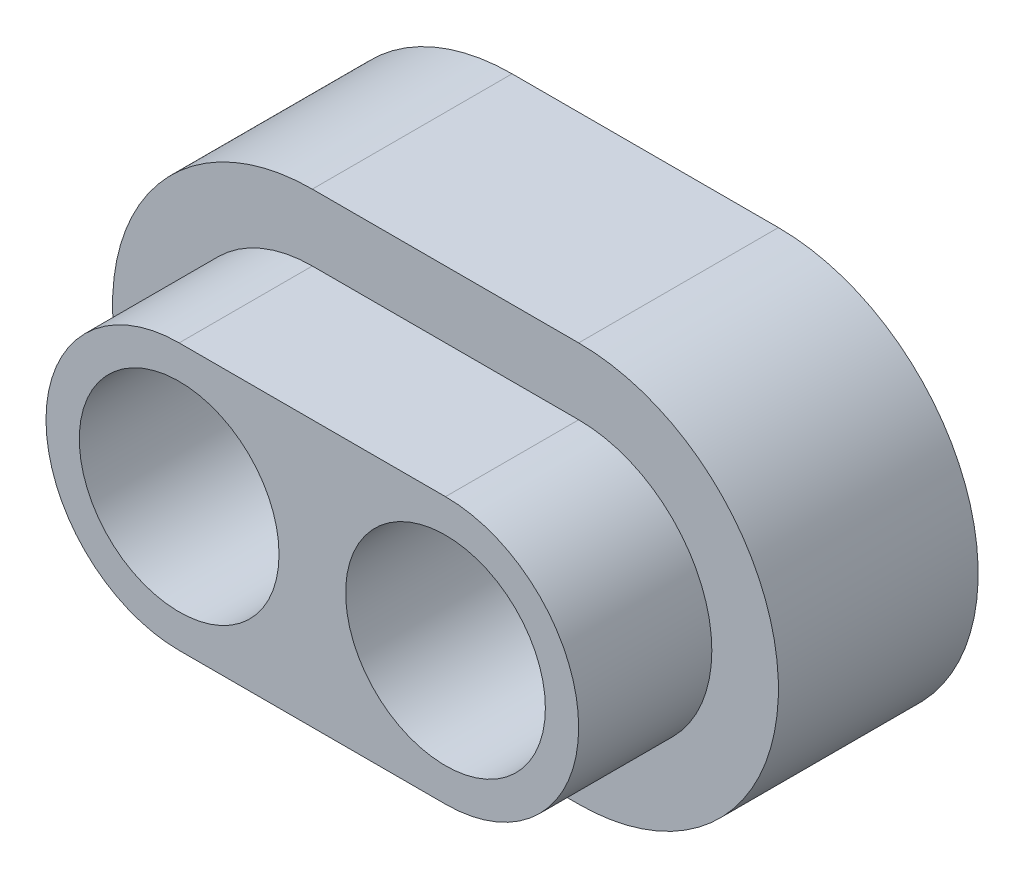
ISO-10303-21;
HEADER;
FILE_DESCRIPTION(('STEP AP214'),'2;1');
FILE_NAME('part.step','',(''),(''),'','','');
FILE_SCHEMA(('AUTOMOTIVE_DESIGN { 1 0 10303 214 1 1 1 1 }'));
ENDSEC;
DATA;
#1=APPLICATION_CONTEXT('core data for automotive mechanical design processes');
#2=APPLICATION_PROTOCOL_DEFINITION('international standard','automotive_design',2000,#1);
#3=PRODUCT_CONTEXT('',#1,'mechanical');
#4=PRODUCT('Part','Part','',(#3));
#5=PRODUCT_RELATED_PRODUCT_CATEGORY('part','',(#4));
#6=PRODUCT_DEFINITION_FORMATION('','',#4);
#7=PRODUCT_DEFINITION_CONTEXT('part definition',#1,'design');
#8=PRODUCT_DEFINITION('design','',#6,#7);
#9=PRODUCT_DEFINITION_SHAPE('','',#8);
#10=(LENGTH_UNIT() NAMED_UNIT(*) SI_UNIT(.MILLI.,.METRE.));
#11=(NAMED_UNIT(*) PLANE_ANGLE_UNIT() SI_UNIT($,.RADIAN.));
#12=(NAMED_UNIT(*) SI_UNIT($,.STERADIAN.) SOLID_ANGLE_UNIT());
#13=UNCERTAINTY_MEASURE_WITH_UNIT(LENGTH_MEASURE(1.E-05),#10,'distance_accuracy_value','');
#14=(GEOMETRIC_REPRESENTATION_CONTEXT(3) GLOBAL_UNCERTAINTY_ASSIGNED_CONTEXT((#13)) GLOBAL_UNIT_ASSIGNED_CONTEXT((#10,
#11,#12)) REPRESENTATION_CONTEXT('',''));
#15=CARTESIAN_POINT('',(0.,0.,0.));
#16=DIRECTION('',(0.,0.,1.));
#17=DIRECTION('',(1.,0.,0.));
#18=AXIS2_PLACEMENT_3D('',#15,#16,#17);
#19=CARTESIAN_POINT('',(-2.,0.,3.));
#20=DIRECTION('',(0.,0.,-1.));
#21=DIRECTION('',(-1.,0.,0.));
#22=AXIS2_PLACEMENT_3D('',#19,#20,#21);
#23=CYLINDRICAL_SURFACE('',#22,3.);
#24=DIRECTION('',(0.,0.,-1.));
#25=VECTOR('',#24,1.);
#26=CARTESIAN_POINT('',(-2.,3.,3.));
#27=LINE('',#26,#25);
#28=CARTESIAN_POINT('',(-2.,3.,0.));
#29=VERTEX_POINT('',#28);
#30=CARTESIAN_POINT('',(-2.,3.,3.));
#31=VERTEX_POINT('',#30);
#32=EDGE_CURVE('E188',#29,#31,#27,.F.);
#33=ORIENTED_EDGE('',*,*,#32,.F.);
#34=CARTESIAN_POINT('',(-2.,0.,0.));
#35=DIRECTION('',(0.,0.,1.));
#36=DIRECTION('',(1.,0.,0.));
#37=AXIS2_PLACEMENT_3D('',#34,#35,#36);
#38=CIRCLE('',#37,3.);
#39=CARTESIAN_POINT('',(-2.,-3.,0.));
#40=VERTEX_POINT('',#39);
#41=EDGE_CURVE('E173',#29,#40,#38,.T.);
#42=ORIENTED_EDGE('',*,*,#41,.T.);
#43=DIRECTION('',(0.,0.,-1.));
#44=VECTOR('',#43,1.);
#45=CARTESIAN_POINT('',(-2.,-3.,3.));
#46=LINE('',#45,#44);
#47=CARTESIAN_POINT('',(-2.,-3.,3.));
#48=VERTEX_POINT('',#47);
#49=EDGE_CURVE('E129',#48,#40,#46,.T.);
#50=ORIENTED_EDGE('',*,*,#49,.F.);
#51=CARTESIAN_POINT('',(-2.,0.,3.));
#52=DIRECTION('',(0.,0.,1.));
#53=DIRECTION('',(1.,0.,0.));
#54=AXIS2_PLACEMENT_3D('',#51,#52,#53);
#55=CIRCLE('',#54,3.);
#56=EDGE_CURVE('E229',#31,#48,#55,.T.);
#57=ORIENTED_EDGE('',*,*,#56,.F.);
#58=EDGE_LOOP('',(#33,#42,#50,#57));
#59=FACE_BOUND('',#58,.T.);
#60=ADVANCED_FACE('F105',(#59),#23,.T.);
#61=CARTESIAN_POINT('',(-2.,0.,0.));
#62=DIRECTION('',(0.,0.,1.));
#63=DIRECTION('',(1.,0.,0.));
#64=AXIS2_PLACEMENT_3D('',#61,#62,#63);
#65=PLANE('',#64);
#66=CARTESIAN_POINT('',(2.,0.,0.));
#67=DIRECTION('',(0.,0.,1.));
#68=DIRECTION('',(1.,0.,0.));
#69=AXIS2_PLACEMENT_3D('',#66,#67,#68);
#70=CIRCLE('',#69,1.5);
#71=CARTESIAN_POINT('',(3.5,0.,0.));
#72=VERTEX_POINT('',#71);
#73=EDGE_CURVE('E274',#72,#72,#70,.T.);
#74=ORIENTED_EDGE('',*,*,#73,.T.);
#75=EDGE_LOOP('',(#74));
#76=FACE_BOUND('',#75,.T.);
#77=CARTESIAN_POINT('',(-2.,0.,0.));
#78=DIRECTION('',(0.,0.,1.));
#79=DIRECTION('',(1.,0.,0.));
#80=AXIS2_PLACEMENT_3D('',#77,#78,#79);
#81=CIRCLE('',#80,1.5);
#82=CARTESIAN_POINT('',(-0.5,0.,0.));
#83=VERTEX_POINT('',#82);
#84=EDGE_CURVE('E271',#83,#83,#81,.T.);
#85=ORIENTED_EDGE('',*,*,#84,.T.);
#86=EDGE_LOOP('',(#85));
#87=FACE_BOUND('',#86,.T.);
#88=DIRECTION('',(1.,0.,0.));
#89=VECTOR('',#88,1.);
#90=CARTESIAN_POINT('',(-2.,3.,0.));
#91=LINE('',#90,#89);
#92=CARTESIAN_POINT('',(2.,3.,0.));
#93=VERTEX_POINT('',#92);
#94=EDGE_CURVE('E155',#29,#93,#91,.T.);
#95=ORIENTED_EDGE('',*,*,#94,.T.);
#96=CARTESIAN_POINT('',(2.,0.,0.));
#97=DIRECTION('',(0.,0.,1.));
#98=DIRECTION('',(1.,0.,0.));
#99=AXIS2_PLACEMENT_3D('',#96,#97,#98);
#100=CIRCLE('',#99,3.);
#101=CARTESIAN_POINT('',(2.,-3.,0.));
#102=VERTEX_POINT('',#101);
#103=EDGE_CURVE('E165',#102,#93,#100,.T.);
#104=ORIENTED_EDGE('',*,*,#103,.F.);
#105=DIRECTION('',(1.,0.,0.));
#106=VECTOR('',#105,1.);
#107=CARTESIAN_POINT('',(-2.,-3.,0.));
#108=LINE('',#107,#106);
#109=EDGE_CURVE('E175',#40,#102,#108,.T.);
#110=ORIENTED_EDGE('',*,*,#109,.F.);
#111=ORIENTED_EDGE('',*,*,#41,.F.);
#112=EDGE_LOOP('',(#95,#104,#110,#111));
#113=FACE_BOUND('',#112,.T.);
#114=ADVANCED_FACE('F172',(#76,#87,#113),#65,.F.);
#115=CARTESIAN_POINT('',(-2.,0.,3.));
#116=DIRECTION('',(0.,0.,1.));
#117=DIRECTION('',(1.,0.,0.));
#118=AXIS2_PLACEMENT_3D('',#115,#116,#117);
#119=PLANE('',#118);
#120=DIRECTION('',(-1.,0.,0.));
#121=VECTOR('',#120,1.);
#122=CARTESIAN_POINT('',(-2.,2.,3.));
#123=LINE('',#122,#121);
#124=CARTESIAN_POINT('',(2.,2.,3.));
#125=VERTEX_POINT('',#124);
#126=CARTESIAN_POINT('',(-2.,2.,3.));
#127=VERTEX_POINT('',#126);
#128=EDGE_CURVE('E12',#125,#127,#123,.T.);
#129=ORIENTED_EDGE('',*,*,#128,.F.);
#130=CARTESIAN_POINT('',(2.,0.,3.));
#131=DIRECTION('',(0.,0.,1.));
#132=DIRECTION('',(1.,0.,0.));
#133=AXIS2_PLACEMENT_3D('',#130,#131,#132);
#134=CIRCLE('',#133,2.);
#135=CARTESIAN_POINT('',(2.,-2.,3.));
#136=VERTEX_POINT('',#135);
#137=EDGE_CURVE('E187',#125,#136,#134,.F.);
#138=ORIENTED_EDGE('',*,*,#137,.T.);
#139=DIRECTION('',(-1.,0.,0.));
#140=VECTOR('',#139,1.);
#141=CARTESIAN_POINT('',(-2.,-2.,3.));
#142=LINE('',#141,#140);
#143=CARTESIAN_POINT('',(-2.,-2.,3.));
#144=VERTEX_POINT('',#143);
#145=EDGE_CURVE('E184',#136,#144,#142,.T.);
#146=ORIENTED_EDGE('',*,*,#145,.T.);
#147=CARTESIAN_POINT('',(-2.,0.,3.));
#148=DIRECTION('',(0.,0.,1.));
#149=DIRECTION('',(1.,0.,0.));
#150=AXIS2_PLACEMENT_3D('',#147,#148,#149);
#151=CIRCLE('',#150,2.);
#152=EDGE_CURVE('E113',#144,#127,#151,.F.);
#153=ORIENTED_EDGE('',*,*,#152,.T.);
#154=EDGE_LOOP('',(#129,#138,#146,#153));
#155=FACE_BOUND('',#154,.T.);
#156=DIRECTION('',(1.,0.,0.));
#157=VECTOR('',#156,1.);
#158=CARTESIAN_POINT('',(-2.,-3.,3.));
#159=LINE('',#158,#157);
#160=CARTESIAN_POINT('',(2.,-3.,3.));
#161=VERTEX_POINT('',#160);
#162=EDGE_CURVE('E174',#48,#161,#159,.T.);
#163=ORIENTED_EDGE('',*,*,#162,.T.);
#164=CARTESIAN_POINT('',(2.,0.,3.));
#165=DIRECTION('',(0.,0.,1.));
#166=DIRECTION('',(1.,0.,0.));
#167=AXIS2_PLACEMENT_3D('',#164,#165,#166);
#168=CIRCLE('',#167,3.);
#169=CARTESIAN_POINT('',(2.,3.,3.));
#170=VERTEX_POINT('',#169);
#171=EDGE_CURVE('E169',#161,#170,#168,.T.);
#172=ORIENTED_EDGE('',*,*,#171,.T.);
#173=DIRECTION('',(1.,0.,0.));
#174=VECTOR('',#173,1.);
#175=CARTESIAN_POINT('',(-2.,3.,3.));
#176=LINE('',#175,#174);
#177=EDGE_CURVE('E158',#31,#170,#176,.T.);
#178=ORIENTED_EDGE('',*,*,#177,.F.);
#179=ORIENTED_EDGE('',*,*,#56,.T.);
#180=EDGE_LOOP('',(#163,#172,#178,#179));
#181=FACE_BOUND('',#180,.T.);
#182=ADVANCED_FACE('F194',(#155,#181),#119,.T.);
#183=CARTESIAN_POINT('',(2.,0.,3.));
#184=DIRECTION('',(0.,0.,-1.));
#185=DIRECTION('',(-1.,0.,0.));
#186=AXIS2_PLACEMENT_3D('',#183,#184,#185);
#187=CYLINDRICAL_SURFACE('',#186,3.);
#188=DIRECTION('',(0.,0.,-1.));
#189=VECTOR('',#188,1.);
#190=CARTESIAN_POINT('',(2.,-3.,3.));
#191=LINE('',#190,#189);
#192=EDGE_CURVE('E162',#161,#102,#191,.T.);
#193=ORIENTED_EDGE('',*,*,#192,.T.);
#194=ORIENTED_EDGE('',*,*,#103,.T.);
#195=DIRECTION('',(0.,0.,-1.));
#196=VECTOR('',#195,1.);
#197=CARTESIAN_POINT('',(2.,3.,3.));
#198=LINE('',#197,#196);
#199=EDGE_CURVE('E151',#170,#93,#198,.T.);
#200=ORIENTED_EDGE('',*,*,#199,.F.);
#201=ORIENTED_EDGE('',*,*,#171,.F.);
#202=EDGE_LOOP('',(#193,#194,#200,#201));
#203=FACE_BOUND('',#202,.T.);
#204=ADVANCED_FACE('F107',(#203),#187,.T.);
#205=CARTESIAN_POINT('',(-2.,3.,3.));
#206=DIRECTION('',(0.,1.,0.));
#207=DIRECTION('',(0.,0.,1.));
#208=AXIS2_PLACEMENT_3D('',#205,#206,#207);
#209=PLANE('',#208);
#210=ORIENTED_EDGE('',*,*,#94,.F.);
#211=ORIENTED_EDGE('',*,*,#32,.T.);
#212=ORIENTED_EDGE('',*,*,#177,.T.);
#213=ORIENTED_EDGE('',*,*,#199,.T.);
#214=EDGE_LOOP('',(#210,#211,#212,#213));
#215=FACE_BOUND('',#214,.T.);
#216=ADVANCED_FACE('F153',(#215),#209,.T.);
#217=CARTESIAN_POINT('',(-2.,-3.,3.));
#218=DIRECTION('',(0.,1.,0.));
#219=DIRECTION('',(0.,0.,1.));
#220=AXIS2_PLACEMENT_3D('',#217,#218,#219);
#221=PLANE('',#220);
#222=ORIENTED_EDGE('',*,*,#109,.T.);
#223=ORIENTED_EDGE('',*,*,#192,.F.);
#224=ORIENTED_EDGE('',*,*,#162,.F.);
#225=ORIENTED_EDGE('',*,*,#49,.T.);
#226=EDGE_LOOP('',(#222,#223,#224,#225));
#227=FACE_BOUND('',#226,.T.);
#228=ADVANCED_FACE('F245',(#227),#221,.F.);
#229=CARTESIAN_POINT('',(-2.,0.,5.));
#230=DIRECTION('',(0.,0.,-1.));
#231=DIRECTION('',(-1.,0.,0.));
#232=AXIS2_PLACEMENT_3D('',#229,#230,#231);
#233=CYLINDRICAL_SURFACE('',#232,2.);
#234=ORIENTED_EDGE('',*,*,#152,.F.);
#235=DIRECTION('',(0.,0.,-1.));
#236=VECTOR('',#235,1.);
#237=CARTESIAN_POINT('',(-2.,-2.,5.));
#238=LINE('',#237,#236);
#239=CARTESIAN_POINT('',(-2.,-2.,5.));
#240=VERTEX_POINT('',#239);
#241=EDGE_CURVE('E120',#240,#144,#238,.T.);
#242=ORIENTED_EDGE('',*,*,#241,.F.);
#243=CARTESIAN_POINT('',(-2.,0.,5.));
#244=DIRECTION('',(0.,0.,1.));
#245=DIRECTION('',(1.,0.,0.));
#246=AXIS2_PLACEMENT_3D('',#243,#244,#245);
#247=CIRCLE('',#246,2.);
#248=CARTESIAN_POINT('',(-2.,2.,5.));
#249=VERTEX_POINT('',#248);
#250=EDGE_CURVE('E206',#249,#240,#247,.T.);
#251=ORIENTED_EDGE('',*,*,#250,.F.);
#252=DIRECTION('',(0.,0.,-1.));
#253=VECTOR('',#252,1.);
#254=CARTESIAN_POINT('',(-2.,2.,5.));
#255=LINE('',#254,#253);
#256=EDGE_CURVE('E170',#127,#249,#255,.F.);
#257=ORIENTED_EDGE('',*,*,#256,.F.);
#258=EDGE_LOOP('',(#234,#242,#251,#257));
#259=FACE_BOUND('',#258,.T.);
#260=ADVANCED_FACE('F200',(#259),#233,.T.);
#261=CARTESIAN_POINT('',(-2.,0.,5.));
#262=DIRECTION('',(0.,0.,1.));
#263=DIRECTION('',(1.,0.,0.));
#264=AXIS2_PLACEMENT_3D('',#261,#262,#263);
#265=PLANE('',#264);
#266=CARTESIAN_POINT('',(2.,0.,5.));
#267=DIRECTION('',(0.,0.,1.));
#268=DIRECTION('',(1.,0.,0.));
#269=AXIS2_PLACEMENT_3D('',#266,#267,#268);
#270=CIRCLE('',#269,1.5);
#271=CARTESIAN_POINT('',(3.5,0.,5.));
#272=VERTEX_POINT('',#271);
#273=EDGE_CURVE('E277',#272,#272,#270,.T.);
#274=ORIENTED_EDGE('',*,*,#273,.F.);
#275=EDGE_LOOP('',(#274));
#276=FACE_BOUND('',#275,.T.);
#277=CARTESIAN_POINT('',(-2.,0.,5.));
#278=DIRECTION('',(0.,0.,1.));
#279=DIRECTION('',(1.,0.,0.));
#280=AXIS2_PLACEMENT_3D('',#277,#278,#279);
#281=CIRCLE('',#280,1.5);
#282=CARTESIAN_POINT('',(-0.5,0.,5.));
#283=VERTEX_POINT('',#282);
#284=EDGE_CURVE('E228',#283,#283,#281,.T.);
#285=ORIENTED_EDGE('',*,*,#284,.F.);
#286=EDGE_LOOP('',(#285));
#287=FACE_BOUND('',#286,.T.);
#288=DIRECTION('',(1.,0.,0.));
#289=VECTOR('',#288,1.);
#290=CARTESIAN_POINT('',(-2.,-2.,5.));
#291=LINE('',#290,#289);
#292=CARTESIAN_POINT('',(2.,-2.,5.));
#293=VERTEX_POINT('',#292);
#294=EDGE_CURVE('E214',#240,#293,#291,.T.);
#295=ORIENTED_EDGE('',*,*,#294,.T.);
#296=CARTESIAN_POINT('',(2.,0.,5.));
#297=DIRECTION('',(0.,0.,1.));
#298=DIRECTION('',(1.,0.,0.));
#299=AXIS2_PLACEMENT_3D('',#296,#297,#298);
#300=CIRCLE('',#299,2.);
#301=CARTESIAN_POINT('',(2.,2.,5.));
#302=VERTEX_POINT('',#301);
#303=EDGE_CURVE('E218',#293,#302,#300,.T.);
#304=ORIENTED_EDGE('',*,*,#303,.T.);
#305=DIRECTION('',(1.,0.,0.));
#306=VECTOR('',#305,1.);
#307=CARTESIAN_POINT('',(-2.,2.,5.));
#308=LINE('',#307,#306);
#309=EDGE_CURVE('E217',#249,#302,#308,.T.);
#310=ORIENTED_EDGE('',*,*,#309,.F.);
#311=ORIENTED_EDGE('',*,*,#250,.T.);
#312=EDGE_LOOP('',(#295,#304,#310,#311));
#313=FACE_BOUND('',#312,.T.);
#314=ADVANCED_FACE('F251',(#276,#287,#313),#265,.T.);
#315=CARTESIAN_POINT('',(2.,0.,5.));
#316=DIRECTION('',(0.,0.,-1.));
#317=DIRECTION('',(-1.,0.,0.));
#318=AXIS2_PLACEMENT_3D('',#315,#316,#317);
#319=CYLINDRICAL_SURFACE('',#318,2.);
#320=ORIENTED_EDGE('',*,*,#137,.F.);
#321=DIRECTION('',(0.,0.,-1.));
#322=VECTOR('',#321,1.);
#323=CARTESIAN_POINT('',(2.,2.,5.));
#324=LINE('',#323,#322);
#325=EDGE_CURVE('E220',#302,#125,#324,.T.);
#326=ORIENTED_EDGE('',*,*,#325,.F.);
#327=ORIENTED_EDGE('',*,*,#303,.F.);
#328=DIRECTION('',(0.,0.,-1.));
#329=VECTOR('',#328,1.);
#330=CARTESIAN_POINT('',(2.,-2.,5.));
#331=LINE('',#330,#329);
#332=EDGE_CURVE('E223',#293,#136,#331,.T.);
#333=ORIENTED_EDGE('',*,*,#332,.T.);
#334=EDGE_LOOP('',(#320,#326,#327,#333));
#335=FACE_BOUND('',#334,.T.);
#336=ADVANCED_FACE('F268',(#335),#319,.T.);
#337=CARTESIAN_POINT('',(-2.,2.,5.));
#338=DIRECTION('',(0.,1.,0.));
#339=DIRECTION('',(0.,0.,1.));
#340=AXIS2_PLACEMENT_3D('',#337,#338,#339);
#341=PLANE('',#340);
#342=ORIENTED_EDGE('',*,*,#325,.T.);
#343=ORIENTED_EDGE('',*,*,#128,.T.);
#344=ORIENTED_EDGE('',*,*,#256,.T.);
#345=ORIENTED_EDGE('',*,*,#309,.T.);
#346=EDGE_LOOP('',(#342,#343,#344,#345));
#347=FACE_BOUND('',#346,.T.);
#348=ADVANCED_FACE('F297',(#347),#341,.T.);
#349=CARTESIAN_POINT('',(-2.,-2.,5.));
#350=DIRECTION('',(0.,1.,0.));
#351=DIRECTION('',(0.,0.,1.));
#352=AXIS2_PLACEMENT_3D('',#349,#350,#351);
#353=PLANE('',#352);
#354=ORIENTED_EDGE('',*,*,#145,.F.);
#355=ORIENTED_EDGE('',*,*,#332,.F.);
#356=ORIENTED_EDGE('',*,*,#294,.F.);
#357=ORIENTED_EDGE('',*,*,#241,.T.);
#358=EDGE_LOOP('',(#354,#355,#356,#357));
#359=FACE_BOUND('',#358,.T.);
#360=ADVANCED_FACE('F266',(#359),#353,.F.);
#361=CARTESIAN_POINT('',(-2.,0.,5.));
#362=DIRECTION('',(0.,0.,-1.));
#363=DIRECTION('',(-1.,0.,0.));
#364=AXIS2_PLACEMENT_3D('',#361,#362,#363);
#365=CYLINDRICAL_SURFACE('',#364,1.5);
#366=ORIENTED_EDGE('',*,*,#284,.T.);
#367=EDGE_LOOP('',(#366));
#368=FACE_BOUND('',#367,.T.);
#369=ORIENTED_EDGE('',*,*,#84,.F.);
#370=EDGE_LOOP('',(#369));
#371=FACE_BOUND('',#370,.T.);
#372=ADVANCED_FACE('F286',(#368,#371),#365,.F.);
#373=CARTESIAN_POINT('',(2.,0.,5.));
#374=DIRECTION('',(0.,0.,-1.));
#375=DIRECTION('',(-1.,0.,0.));
#376=AXIS2_PLACEMENT_3D('',#373,#374,#375);
#377=CYLINDRICAL_SURFACE('',#376,1.5);
#378=ORIENTED_EDGE('',*,*,#273,.T.);
#379=EDGE_LOOP('',(#378));
#380=FACE_BOUND('',#379,.T.);
#381=ORIENTED_EDGE('',*,*,#73,.F.);
#382=EDGE_LOOP('',(#381));
#383=FACE_BOUND('',#382,.T.);
#384=ADVANCED_FACE('F284',(#380,#383),#377,.F.);
#385=CLOSED_SHELL('',(#60,#114,#182,#204,#216,#228,#260,#314,#336,#348,#360,#372,#384));
#386=MANIFOLD_SOLID_BREP('B2',#385);
#387=ADVANCED_BREP_SHAPE_REPRESENTATION('',(#18,#386),#14);
#388=SHAPE_DEFINITION_REPRESENTATION(#9,#387);
ENDSEC;
END-ISO-10303-21;
